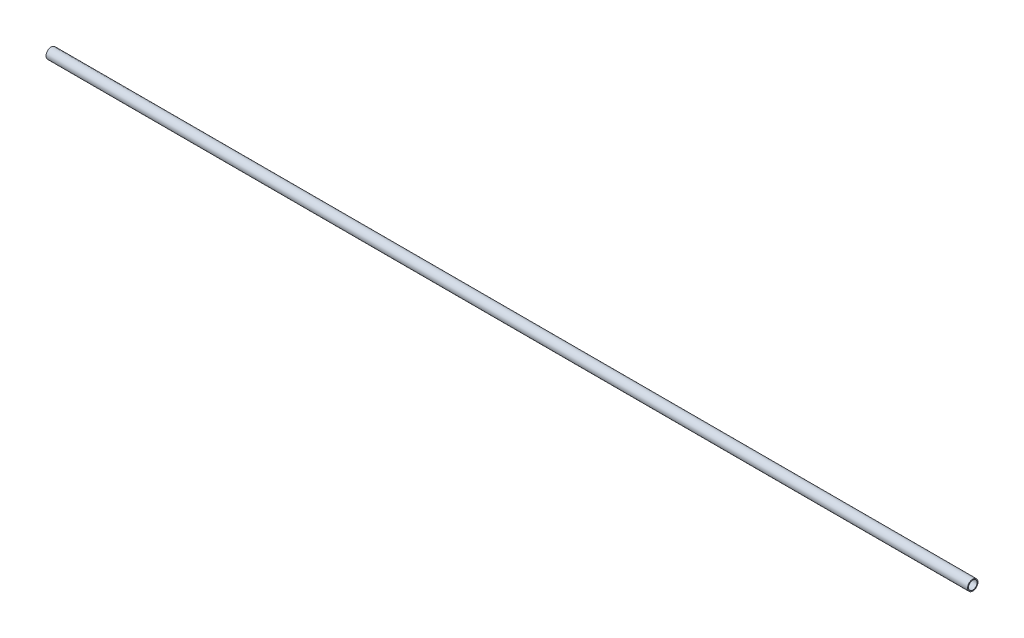
ISO-10303-21;
HEADER;
FILE_DESCRIPTION(('STEP AP214'),'2;1');
FILE_NAME('part.step','',(''),(''),'','','');
FILE_SCHEMA(('AUTOMOTIVE_DESIGN { 1 0 10303 214 1 1 1 1 }'));
ENDSEC;
DATA;
#1=APPLICATION_CONTEXT('core data for automotive mechanical design processes');
#2=APPLICATION_PROTOCOL_DEFINITION('international standard','automotive_design',2000,#1);
#3=PRODUCT_CONTEXT('',#1,'mechanical');
#4=PRODUCT('Part','Part','',(#3));
#5=PRODUCT_RELATED_PRODUCT_CATEGORY('part','',(#4));
#6=PRODUCT_DEFINITION_FORMATION('','',#4);
#7=PRODUCT_DEFINITION_CONTEXT('part definition',#1,'design');
#8=PRODUCT_DEFINITION('design','',#6,#7);
#9=PRODUCT_DEFINITION_SHAPE('','',#8);
#10=(LENGTH_UNIT() NAMED_UNIT(*) SI_UNIT(.MILLI.,.METRE.));
#11=(NAMED_UNIT(*) PLANE_ANGLE_UNIT() SI_UNIT($,.RADIAN.));
#12=(NAMED_UNIT(*) SI_UNIT($,.STERADIAN.) SOLID_ANGLE_UNIT());
#13=UNCERTAINTY_MEASURE_WITH_UNIT(LENGTH_MEASURE(1.E-05),#10,'distance_accuracy_value','');
#14=(GEOMETRIC_REPRESENTATION_CONTEXT(3) GLOBAL_UNCERTAINTY_ASSIGNED_CONTEXT((#13)) GLOBAL_UNIT_ASSIGNED_CONTEXT((#10,
#11,#12)) REPRESENTATION_CONTEXT('',''));
#15=CARTESIAN_POINT('',(0.,0.,0.));
#16=DIRECTION('',(0.,0.,1.));
#17=DIRECTION('',(1.,0.,0.));
#18=AXIS2_PLACEMENT_3D('',#15,#16,#17);
#19=CARTESIAN_POINT('',(110.,0.,0.));
#20=DIRECTION('',(1.,0.,0.));
#21=DIRECTION('',(0.,0.,-1.));
#22=AXIS2_PLACEMENT_3D('',#19,#20,#21);
#23=PLANE('',#22);
#24=CARTESIAN_POINT('',(110.,0.,0.));
#25=DIRECTION('',(1.,0.,0.));
#26=DIRECTION('',(0.,0.,-1.));
#27=AXIS2_PLACEMENT_3D('',#24,#25,#26);
#28=CIRCLE('',#27,0.6223);
#29=CARTESIAN_POINT('',(110.,0.,-0.6223));
#30=VERTEX_POINT('',#29);
#31=EDGE_CURVE('E10',#30,#30,#28,.T.);
#32=ORIENTED_EDGE('',*,*,#31,.T.);
#33=EDGE_LOOP('',(#32));
#34=FACE_BOUND('',#33,.T.);
#35=CARTESIAN_POINT('',(110.,0.,0.));
#36=DIRECTION('',(1.,0.,0.));
#37=DIRECTION('',(0.,0.,-1.));
#38=AXIS2_PLACEMENT_3D('',#35,#36,#37);
#39=CIRCLE('',#38,0.51435);
#40=CARTESIAN_POINT('',(110.,0.,-0.51435));
#41=VERTEX_POINT('',#40);
#42=EDGE_CURVE('E42',#41,#41,#39,.T.);
#43=ORIENTED_EDGE('',*,*,#42,.F.);
#44=EDGE_LOOP('',(#43));
#45=FACE_BOUND('',#44,.T.);
#46=ADVANCED_FACE('F31',(#34,#45),#23,.T.);
#47=CARTESIAN_POINT('',(0.,0.,0.));
#48=DIRECTION('',(1.,0.,0.));
#49=DIRECTION('',(0.,0.,-1.));
#50=AXIS2_PLACEMENT_3D('',#47,#48,#49);
#51=PLANE('',#50);
#52=CARTESIAN_POINT('',(0.,0.,0.));
#53=DIRECTION('',(1.,0.,0.));
#54=DIRECTION('',(0.,0.,-1.));
#55=AXIS2_PLACEMENT_3D('',#52,#53,#54);
#56=CIRCLE('',#55,0.6223);
#57=CARTESIAN_POINT('',(0.,0.,-0.6223));
#58=VERTEX_POINT('',#57);
#59=EDGE_CURVE('E35',#58,#58,#56,.T.);
#60=ORIENTED_EDGE('',*,*,#59,.F.);
#61=EDGE_LOOP('',(#60));
#62=FACE_BOUND('',#61,.T.);
#63=CARTESIAN_POINT('',(0.,0.,0.));
#64=DIRECTION('',(1.,0.,0.));
#65=DIRECTION('',(0.,0.,-1.));
#66=AXIS2_PLACEMENT_3D('',#63,#64,#65);
#67=CIRCLE('',#66,0.51435);
#68=CARTESIAN_POINT('',(0.,0.,-0.51435));
#69=VERTEX_POINT('',#68);
#70=EDGE_CURVE('E44',#69,#69,#67,.T.);
#71=ORIENTED_EDGE('',*,*,#70,.T.);
#72=EDGE_LOOP('',(#71));
#73=FACE_BOUND('',#72,.T.);
#74=ADVANCED_FACE('F54',(#62,#73),#51,.F.);
#75=CARTESIAN_POINT('',(110.,0.,0.));
#76=DIRECTION('',(-1.,0.,0.));
#77=DIRECTION('',(0.,0.,1.));
#78=AXIS2_PLACEMENT_3D('',#75,#76,#77);
#79=CYLINDRICAL_SURFACE('',#78,0.6223);
#80=ORIENTED_EDGE('',*,*,#31,.F.);
#81=EDGE_LOOP('',(#80));
#82=FACE_BOUND('',#81,.T.);
#83=ORIENTED_EDGE('',*,*,#59,.T.);
#84=EDGE_LOOP('',(#83));
#85=FACE_BOUND('',#84,.T.);
#86=ADVANCED_FACE('F33',(#82,#85),#79,.T.);
#87=CARTESIAN_POINT('',(110.,0.,0.));
#88=DIRECTION('',(-1.,0.,0.));
#89=DIRECTION('',(0.,0.,1.));
#90=AXIS2_PLACEMENT_3D('',#87,#88,#89);
#91=CYLINDRICAL_SURFACE('',#90,0.51435);
#92=ORIENTED_EDGE('',*,*,#42,.T.);
#93=EDGE_LOOP('',(#92));
#94=FACE_BOUND('',#93,.T.);
#95=ORIENTED_EDGE('',*,*,#70,.F.);
#96=EDGE_LOOP('',(#95));
#97=FACE_BOUND('',#96,.T.);
#98=ADVANCED_FACE('F50',(#94,#97),#91,.F.);
#99=CLOSED_SHELL('',(#46,#74,#86,#98));
#100=MANIFOLD_SOLID_BREP('B2',#99);
#101=ADVANCED_BREP_SHAPE_REPRESENTATION('',(#18,#100),#14);
#102=SHAPE_DEFINITION_REPRESENTATION(#9,#101);
ENDSEC;
END-ISO-10303-21;
